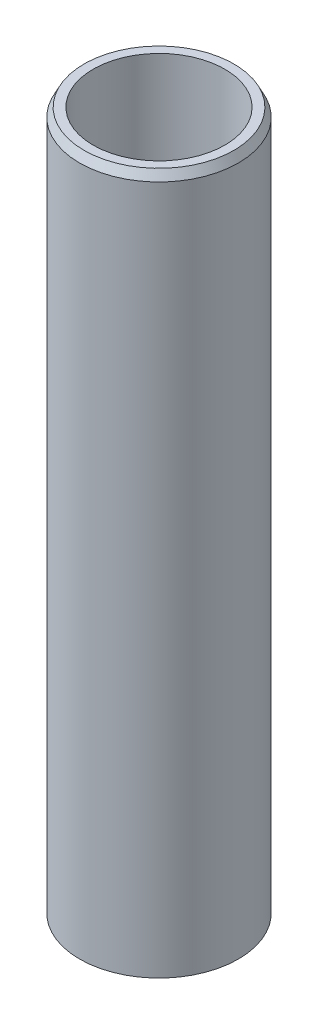
ISO-10303-21;
HEADER;
FILE_DESCRIPTION(('STEP AP214'),'2;1');
FILE_NAME('part.step','',(''),(''),'','','');
FILE_SCHEMA(('AUTOMOTIVE_DESIGN { 1 0 10303 214 1 1 1 1 }'));
ENDSEC;
DATA;
#1=APPLICATION_CONTEXT('core data for automotive mechanical design processes');
#2=APPLICATION_PROTOCOL_DEFINITION('international standard','automotive_design',2000,#1);
#3=PRODUCT_CONTEXT('',#1,'mechanical');
#4=PRODUCT('Part','Part','',(#3));
#5=PRODUCT_RELATED_PRODUCT_CATEGORY('part','',(#4));
#6=PRODUCT_DEFINITION_FORMATION('','',#4);
#7=PRODUCT_DEFINITION_CONTEXT('part definition',#1,'design');
#8=PRODUCT_DEFINITION('design','',#6,#7);
#9=PRODUCT_DEFINITION_SHAPE('','',#8);
#10=(LENGTH_UNIT() NAMED_UNIT(*) SI_UNIT(.MILLI.,.METRE.));
#11=(NAMED_UNIT(*) PLANE_ANGLE_UNIT() SI_UNIT($,.RADIAN.));
#12=(NAMED_UNIT(*) SI_UNIT($,.STERADIAN.) SOLID_ANGLE_UNIT());
#13=UNCERTAINTY_MEASURE_WITH_UNIT(LENGTH_MEASURE(1.E-05),#10,'distance_accuracy_value','');
#14=(GEOMETRIC_REPRESENTATION_CONTEXT(3) GLOBAL_UNCERTAINTY_ASSIGNED_CONTEXT((#13)) GLOBAL_UNIT_ASSIGNED_CONTEXT((#10,
#11,#12)) REPRESENTATION_CONTEXT('',''));
#15=CARTESIAN_POINT('',(0.,0.,0.));
#16=DIRECTION('',(0.,0.,1.));
#17=DIRECTION('',(1.,0.,0.));
#18=AXIS2_PLACEMENT_3D('',#15,#16,#17);
#19=CARTESIAN_POINT('',(0.,243.434436390935,0.));
#20=DIRECTION('',(0.,-1.,0.));
#21=DIRECTION('',(0.,0.,-1.));
#22=AXIS2_PLACEMENT_3D('',#19,#20,#21);
#23=CYLINDRICAL_SURFACE('',#22,27.5);
#24=CARTESIAN_POINT('',(0.,240.416068255823,0.));
#25=DIRECTION('',(0.,1.,0.));
#26=DIRECTION('',(0.,0.,1.));
#27=AXIS2_PLACEMENT_3D('',#24,#25,#26);
#28=CIRCLE('',#27,27.5);
#29=CARTESIAN_POINT('',(0.,240.416068255823,27.5));
#30=VERTEX_POINT('',#29);
#31=EDGE_CURVE('E50',#30,#30,#28,.F.);
#32=ORIENTED_EDGE('',*,*,#31,.T.);
#33=EDGE_LOOP('',(#32));
#34=FACE_BOUND('',#33,.T.);
#35=CARTESIAN_POINT('',(0.,1.54504172223116,0.));
#36=DIRECTION('',(0.,1.,0.));
#37=DIRECTION('',(0.,0.,1.));
#38=AXIS2_PLACEMENT_3D('',#35,#36,#37);
#39=CIRCLE('',#38,27.5);
#40=CARTESIAN_POINT('',(0.,1.54504172223116,27.5));
#41=VERTEX_POINT('',#40);
#42=EDGE_CURVE('E51',#41,#41,#39,.T.);
#43=ORIENTED_EDGE('',*,*,#42,.T.);
#44=EDGE_LOOP('',(#43));
#45=FACE_BOUND('',#44,.T.);
#46=ADVANCED_FACE('F39',(#34,#45),#23,.T.);
#47=CARTESIAN_POINT('',(0.,243.434436390935,0.));
#48=DIRECTION('',(0.,1.,0.));
#49=DIRECTION('',(0.,0.,1.));
#50=AXIS2_PLACEMENT_3D('',#47,#48,#49);
#51=PLANE('',#50);
#52=CARTESIAN_POINT('',(0.,243.434436390935,0.));
#53=DIRECTION('',(0.,1.,0.));
#54=DIRECTION('',(0.,0.,1.));
#55=AXIS2_PLACEMENT_3D('',#52,#53,#54);
#56=CIRCLE('',#55,25.9549582777688);
#57=CARTESIAN_POINT('',(0.,243.434436390935,25.9549582777688));
#58=VERTEX_POINT('',#57);
#59=EDGE_CURVE('E54',#58,#58,#56,.T.);
#60=ORIENTED_EDGE('',*,*,#59,.T.);
#61=EDGE_LOOP('',(#60));
#62=FACE_BOUND('',#61,.T.);
#63=CARTESIAN_POINT('',(0.,243.434436390935,0.));
#64=DIRECTION('',(0.,1.,0.));
#65=DIRECTION('',(0.,0.,1.));
#66=AXIS2_PLACEMENT_3D('',#63,#64,#65);
#67=CIRCLE('',#66,22.8126075471136);
#68=CARTESIAN_POINT('',(0.,243.434436390935,22.8126075471136));
#69=VERTEX_POINT('',#68);
#70=EDGE_CURVE('E58',#69,#69,#67,.T.);
#71=ORIENTED_EDGE('',*,*,#70,.F.);
#72=EDGE_LOOP('',(#71));
#73=FACE_BOUND('',#72,.T.);
#74=ADVANCED_FACE('F69',(#62,#73),#51,.T.);
#75=CARTESIAN_POINT('',(0.,0.,0.));
#76=DIRECTION('',(0.,1.,0.));
#77=DIRECTION('',(0.,0.,1.));
#78=AXIS2_PLACEMENT_3D('',#75,#76,#77);
#79=PLANE('',#78);
#80=CARTESIAN_POINT('',(0.,0.,0.));
#81=DIRECTION('',(0.,1.,0.));
#82=DIRECTION('',(0.,0.,1.));
#83=AXIS2_PLACEMENT_3D('',#80,#81,#82);
#84=CIRCLE('',#83,24.4816318648884);
#85=CARTESIAN_POINT('',(0.,0.,24.4816318648884));
#86=VERTEX_POINT('',#85);
#87=EDGE_CURVE('E10',#86,#86,#84,.F.);
#88=ORIENTED_EDGE('',*,*,#87,.T.);
#89=EDGE_LOOP('',(#88));
#90=FACE_BOUND('',#89,.T.);
#91=CARTESIAN_POINT('',(0.,0.,0.));
#92=DIRECTION('',(0.,1.,0.));
#93=DIRECTION('',(0.,0.,1.));
#94=AXIS2_PLACEMENT_3D('',#91,#92,#93);
#95=CIRCLE('',#94,22.8126075471136);
#96=CARTESIAN_POINT('',(0.,0.,22.8126075471136));
#97=VERTEX_POINT('',#96);
#98=EDGE_CURVE('E63',#97,#97,#95,.T.);
#99=ORIENTED_EDGE('',*,*,#98,.T.);
#100=EDGE_LOOP('',(#99));
#101=FACE_BOUND('',#100,.T.);
#102=ADVANCED_FACE('F75',(#90,#101),#79,.F.);
#103=CARTESIAN_POINT('',(0.,243.434436390935,0.));
#104=DIRECTION('',(0.,-1.,0.));
#105=DIRECTION('',(0.,0.,-1.));
#106=AXIS2_PLACEMENT_3D('',#103,#104,#105);
#107=CYLINDRICAL_SURFACE('',#106,22.8126075471136);
#108=ORIENTED_EDGE('',*,*,#70,.T.);
#109=EDGE_LOOP('',(#108));
#110=FACE_BOUND('',#109,.T.);
#111=ORIENTED_EDGE('',*,*,#98,.F.);
#112=EDGE_LOOP('',(#111));
#113=FACE_BOUND('',#112,.T.);
#114=ADVANCED_FACE('F70',(#110,#113),#107,.F.);
#115=CARTESIAN_POINT('',(0.,243.434436390935,0.));
#116=DIRECTION('',(0.,-1.,0.));
#117=DIRECTION('',(0.,0.,-1.));
#118=AXIS2_PLACEMENT_3D('',#115,#116,#117);
#119=CONICAL_SURFACE('',#118,25.9549582777688,0.473106230807826);
#120=ORIENTED_EDGE('',*,*,#31,.F.);
#121=EDGE_LOOP('',(#120));
#122=FACE_BOUND('',#121,.T.);
#123=ORIENTED_EDGE('',*,*,#59,.F.);
#124=EDGE_LOOP('',(#123));
#125=FACE_BOUND('',#124,.T.);
#126=ADVANCED_FACE('F81',(#122,#125),#119,.T.);
#127=CARTESIAN_POINT('',(0.,1.54504172223116,0.));
#128=DIRECTION('',(0.,1.,0.));
#129=DIRECTION('',(0.,0.,1.));
#130=AXIS2_PLACEMENT_3D('',#127,#128,#129);
#131=CONICAL_SURFACE('',#130,27.5,1.09769009598708);
#132=ORIENTED_EDGE('',*,*,#87,.F.);
#133=EDGE_LOOP('',(#132));
#134=FACE_BOUND('',#133,.T.);
#135=ORIENTED_EDGE('',*,*,#42,.F.);
#136=EDGE_LOOP('',(#135));
#137=FACE_BOUND('',#136,.T.);
#138=ADVANCED_FACE('F45',(#134,#137),#131,.T.);
#139=CLOSED_SHELL('',(#46,#74,#102,#114,#126,#138));
#140=MANIFOLD_SOLID_BREP('B2',#139);
#141=ADVANCED_BREP_SHAPE_REPRESENTATION('',(#18,#140),#14);
#142=SHAPE_DEFINITION_REPRESENTATION(#9,#141);
ENDSEC;
END-ISO-10303-21;
